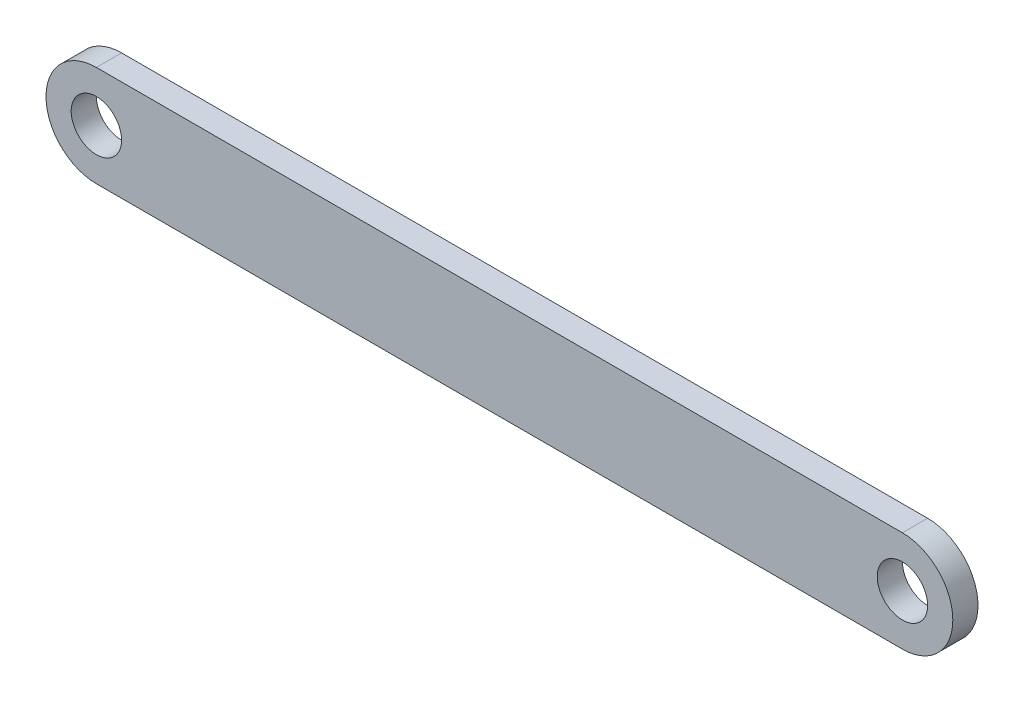
ISO-10303-21;
HEADER;
FILE_DESCRIPTION(('STEP AP214'),'2;1');
FILE_NAME('part.step','',(''),(''),'','','');
FILE_SCHEMA(('AUTOMOTIVE_DESIGN { 1 0 10303 214 1 1 1 1 }'));
ENDSEC;
DATA;
#1=APPLICATION_CONTEXT('core data for automotive mechanical design processes');
#2=APPLICATION_PROTOCOL_DEFINITION('international standard','automotive_design',2000,#1);
#3=PRODUCT_CONTEXT('',#1,'mechanical');
#4=PRODUCT('Part','Part','',(#3));
#5=PRODUCT_RELATED_PRODUCT_CATEGORY('part','',(#4));
#6=PRODUCT_DEFINITION_FORMATION('','',#4);
#7=PRODUCT_DEFINITION_CONTEXT('part definition',#1,'design');
#8=PRODUCT_DEFINITION('design','',#6,#7);
#9=PRODUCT_DEFINITION_SHAPE('','',#8);
#10=(LENGTH_UNIT() NAMED_UNIT(*) SI_UNIT(.MILLI.,.METRE.));
#11=(NAMED_UNIT(*) PLANE_ANGLE_UNIT() SI_UNIT($,.RADIAN.));
#12=(NAMED_UNIT(*) SI_UNIT($,.STERADIAN.) SOLID_ANGLE_UNIT());
#13=UNCERTAINTY_MEASURE_WITH_UNIT(LENGTH_MEASURE(1.E-05),#10,'distance_accuracy_value','');
#14=(GEOMETRIC_REPRESENTATION_CONTEXT(3) GLOBAL_UNCERTAINTY_ASSIGNED_CONTEXT((#13)) GLOBAL_UNIT_ASSIGNED_CONTEXT((#10,
#11,#12)) REPRESENTATION_CONTEXT('',''));
#15=CARTESIAN_POINT('',(0.,0.,0.));
#16=DIRECTION('',(0.,0.,1.));
#17=DIRECTION('',(1.,0.,0.));
#18=AXIS2_PLACEMENT_3D('',#15,#16,#17);
#19=CARTESIAN_POINT('',(-101.6,0.,6.35));
#20=DIRECTION('',(0.,0.,-1.));
#21=DIRECTION('',(-1.,0.,0.));
#22=AXIS2_PLACEMENT_3D('',#19,#20,#21);
#23=CYLINDRICAL_SURFACE('',#22,12.7);
#24=CARTESIAN_POINT('',(-101.6,0.,0.));
#25=DIRECTION('',(0.,0.,1.));
#26=DIRECTION('',(-1.,0.,0.));
#27=AXIS2_PLACEMENT_3D('',#24,#25,#26);
#28=CIRCLE('',#27,12.7);
#29=CARTESIAN_POINT('',(-101.6,12.7,0.));
#30=VERTEX_POINT('',#29);
#31=CARTESIAN_POINT('',(-101.6,-12.7,0.));
#32=VERTEX_POINT('',#31);
#33=EDGE_CURVE('E95',#30,#32,#28,.T.);
#34=ORIENTED_EDGE('',*,*,#33,.T.);
#35=DIRECTION('',(0.,0.,-1.));
#36=VECTOR('',#35,1.);
#37=CARTESIAN_POINT('',(-101.6,-12.7,6.35));
#38=LINE('',#37,#36);
#39=CARTESIAN_POINT('',(-101.6,-12.7,6.35));
#40=VERTEX_POINT('',#39);
#41=EDGE_CURVE('E11',#40,#32,#38,.T.);
#42=ORIENTED_EDGE('',*,*,#41,.F.);
#43=CARTESIAN_POINT('',(-101.6,0.,6.35));
#44=DIRECTION('',(0.,0.,1.));
#45=DIRECTION('',(-1.,0.,0.));
#46=AXIS2_PLACEMENT_3D('',#43,#44,#45);
#47=CIRCLE('',#46,12.7);
#48=CARTESIAN_POINT('',(-101.6,12.7,6.35));
#49=VERTEX_POINT('',#48);
#50=EDGE_CURVE('E83',#49,#40,#47,.T.);
#51=ORIENTED_EDGE('',*,*,#50,.F.);
#52=DIRECTION('',(0.,0.,-1.));
#53=VECTOR('',#52,1.);
#54=CARTESIAN_POINT('',(-101.6,12.7,6.35));
#55=LINE('',#54,#53);
#56=EDGE_CURVE('E91',#49,#30,#55,.T.);
#57=ORIENTED_EDGE('',*,*,#56,.T.);
#58=EDGE_LOOP('',(#34,#42,#51,#57));
#59=FACE_BOUND('',#58,.T.);
#60=ADVANCED_FACE('F32',(#59),#23,.T.);
#61=CARTESIAN_POINT('',(-101.6,-12.7,6.35));
#62=DIRECTION('',(0.,1.,0.));
#63=DIRECTION('',(-1.,0.,0.));
#64=AXIS2_PLACEMENT_3D('',#61,#62,#63);
#65=PLANE('',#64);
#66=DIRECTION('',(1.,0.,0.));
#67=VECTOR('',#66,1.);
#68=CARTESIAN_POINT('',(-101.6,-12.7,0.));
#69=LINE('',#68,#67);
#70=CARTESIAN_POINT('',(101.6,-12.7,0.));
#71=VERTEX_POINT('',#70);
#72=EDGE_CURVE('E87',#32,#71,#69,.T.);
#73=ORIENTED_EDGE('',*,*,#72,.T.);
#74=DIRECTION('',(0.,0.,-1.));
#75=VECTOR('',#74,1.);
#76=CARTESIAN_POINT('',(101.6,-12.7,6.35));
#77=LINE('',#76,#75);
#78=CARTESIAN_POINT('',(101.6,-12.7,6.35));
#79=VERTEX_POINT('',#78);
#80=EDGE_CURVE('E40',#79,#71,#77,.T.);
#81=ORIENTED_EDGE('',*,*,#80,.F.);
#82=DIRECTION('',(1.,0.,0.));
#83=VECTOR('',#82,1.);
#84=CARTESIAN_POINT('',(-101.6,-12.7,6.35));
#85=LINE('',#84,#83);
#86=EDGE_CURVE('E78',#40,#79,#85,.T.);
#87=ORIENTED_EDGE('',*,*,#86,.F.);
#88=ORIENTED_EDGE('',*,*,#41,.T.);
#89=EDGE_LOOP('',(#73,#81,#87,#88));
#90=FACE_BOUND('',#89,.T.);
#91=ADVANCED_FACE('F86',(#90),#65,.F.);
#92=CARTESIAN_POINT('',(101.6,0.,6.35));
#93=DIRECTION('',(0.,0.,-1.));
#94=DIRECTION('',(-1.,0.,0.));
#95=AXIS2_PLACEMENT_3D('',#92,#93,#94);
#96=CYLINDRICAL_SURFACE('',#95,12.7);
#97=CARTESIAN_POINT('',(101.6,0.,0.));
#98=DIRECTION('',(0.,0.,1.));
#99=DIRECTION('',(-1.,0.,0.));
#100=AXIS2_PLACEMENT_3D('',#97,#98,#99);
#101=CIRCLE('',#100,12.7);
#102=CARTESIAN_POINT('',(101.6,12.7,0.));
#103=VERTEX_POINT('',#102);
#104=EDGE_CURVE('E65',#71,#103,#101,.T.);
#105=ORIENTED_EDGE('',*,*,#104,.T.);
#106=DIRECTION('',(0.,0.,-1.));
#107=VECTOR('',#106,1.);
#108=CARTESIAN_POINT('',(101.6,12.7,6.35));
#109=LINE('',#108,#107);
#110=CARTESIAN_POINT('',(101.6,12.7,6.35));
#111=VERTEX_POINT('',#110);
#112=EDGE_CURVE('E88',#111,#103,#109,.T.);
#113=ORIENTED_EDGE('',*,*,#112,.F.);
#114=CARTESIAN_POINT('',(101.6,0.,6.35));
#115=DIRECTION('',(0.,0.,1.));
#116=DIRECTION('',(-1.,0.,0.));
#117=AXIS2_PLACEMENT_3D('',#114,#115,#116);
#118=CIRCLE('',#117,12.7);
#119=EDGE_CURVE('E81',#79,#111,#118,.T.);
#120=ORIENTED_EDGE('',*,*,#119,.F.);
#121=ORIENTED_EDGE('',*,*,#80,.T.);
#122=EDGE_LOOP('',(#105,#113,#120,#121));
#123=FACE_BOUND('',#122,.T.);
#124=ADVANCED_FACE('F89',(#123),#96,.T.);
#125=CARTESIAN_POINT('',(-101.6,12.7,6.35));
#126=DIRECTION('',(0.,-1.,0.));
#127=DIRECTION('',(1.,0.,0.));
#128=AXIS2_PLACEMENT_3D('',#125,#126,#127);
#129=PLANE('',#128);
#130=DIRECTION('',(-1.,0.,0.));
#131=VECTOR('',#130,1.);
#132=CARTESIAN_POINT('',(-101.6,12.7,0.));
#133=LINE('',#132,#131);
#134=EDGE_CURVE('E71',#103,#30,#133,.T.);
#135=ORIENTED_EDGE('',*,*,#134,.T.);
#136=ORIENTED_EDGE('',*,*,#56,.F.);
#137=DIRECTION('',(-1.,0.,0.));
#138=VECTOR('',#137,1.);
#139=CARTESIAN_POINT('',(-101.6,12.7,6.35));
#140=LINE('',#139,#138);
#141=EDGE_CURVE('E48',#111,#49,#140,.T.);
#142=ORIENTED_EDGE('',*,*,#141,.F.);
#143=ORIENTED_EDGE('',*,*,#112,.T.);
#144=EDGE_LOOP('',(#135,#136,#142,#143));
#145=FACE_BOUND('',#144,.T.);
#146=ADVANCED_FACE('F103',(#145),#129,.F.);
#147=CARTESIAN_POINT('',(-101.6,0.,6.35));
#148=DIRECTION('',(0.,0.,-1.));
#149=DIRECTION('',(-1.,0.,0.));
#150=AXIS2_PLACEMENT_3D('',#147,#148,#149);
#151=PLANE('',#150);
#152=CARTESIAN_POINT('',(101.6,0.,6.35));
#153=DIRECTION('',(0.,0.,1.));
#154=DIRECTION('',(1.,0.,0.));
#155=AXIS2_PLACEMENT_3D('',#152,#153,#154);
#156=CIRCLE('',#155,6.35);
#157=CARTESIAN_POINT('',(107.95,0.,6.35));
#158=VERTEX_POINT('',#157);
#159=EDGE_CURVE('E115',#158,#158,#156,.T.);
#160=ORIENTED_EDGE('',*,*,#159,.F.);
#161=EDGE_LOOP('',(#160));
#162=FACE_BOUND('',#161,.T.);
#163=CARTESIAN_POINT('',(-101.6,0.,6.35));
#164=DIRECTION('',(0.,0.,1.));
#165=DIRECTION('',(1.,0.,0.));
#166=AXIS2_PLACEMENT_3D('',#163,#164,#165);
#167=CIRCLE('',#166,6.35);
#168=CARTESIAN_POINT('',(-95.25,0.,6.35));
#169=VERTEX_POINT('',#168);
#170=EDGE_CURVE('E109',#169,#169,#167,.T.);
#171=ORIENTED_EDGE('',*,*,#170,.F.);
#172=EDGE_LOOP('',(#171));
#173=FACE_BOUND('',#172,.T.);
#174=ORIENTED_EDGE('',*,*,#50,.T.);
#175=ORIENTED_EDGE('',*,*,#86,.T.);
#176=ORIENTED_EDGE('',*,*,#119,.T.);
#177=ORIENTED_EDGE('',*,*,#141,.T.);
#178=EDGE_LOOP('',(#174,#175,#176,#177));
#179=FACE_BOUND('',#178,.T.);
#180=ADVANCED_FACE('F79',(#162,#173,#179),#151,.F.);
#181=CARTESIAN_POINT('',(-101.6,0.,0.));
#182=DIRECTION('',(0.,0.,-1.));
#183=DIRECTION('',(-1.,0.,0.));
#184=AXIS2_PLACEMENT_3D('',#181,#182,#183);
#185=PLANE('',#184);
#186=CARTESIAN_POINT('',(101.6,0.,0.));
#187=DIRECTION('',(0.,0.,1.));
#188=DIRECTION('',(1.,0.,0.));
#189=AXIS2_PLACEMENT_3D('',#186,#187,#188);
#190=CIRCLE('',#189,6.35);
#191=CARTESIAN_POINT('',(107.95,0.,0.));
#192=VERTEX_POINT('',#191);
#193=EDGE_CURVE('E112',#192,#192,#190,.T.);
#194=ORIENTED_EDGE('',*,*,#193,.T.);
#195=EDGE_LOOP('',(#194));
#196=FACE_BOUND('',#195,.T.);
#197=CARTESIAN_POINT('',(-101.6,0.,0.));
#198=DIRECTION('',(0.,0.,1.));
#199=DIRECTION('',(1.,0.,0.));
#200=AXIS2_PLACEMENT_3D('',#197,#198,#199);
#201=CIRCLE('',#200,6.35);
#202=CARTESIAN_POINT('',(-95.25,0.,0.));
#203=VERTEX_POINT('',#202);
#204=EDGE_CURVE('E98',#203,#203,#201,.T.);
#205=ORIENTED_EDGE('',*,*,#204,.T.);
#206=EDGE_LOOP('',(#205));
#207=FACE_BOUND('',#206,.T.);
#208=ORIENTED_EDGE('',*,*,#33,.F.);
#209=ORIENTED_EDGE('',*,*,#134,.F.);
#210=ORIENTED_EDGE('',*,*,#104,.F.);
#211=ORIENTED_EDGE('',*,*,#72,.F.);
#212=EDGE_LOOP('',(#208,#209,#210,#211));
#213=FACE_BOUND('',#212,.T.);
#214=ADVANCED_FACE('F106',(#196,#207,#213),#185,.T.);
#215=CARTESIAN_POINT('',(-101.6,0.,0.));
#216=DIRECTION('',(0.,0.,1.));
#217=DIRECTION('',(1.,0.,0.));
#218=AXIS2_PLACEMENT_3D('',#215,#216,#217);
#219=CYLINDRICAL_SURFACE('',#218,6.35);
#220=ORIENTED_EDGE('',*,*,#204,.F.);
#221=EDGE_LOOP('',(#220));
#222=FACE_BOUND('',#221,.T.);
#223=ORIENTED_EDGE('',*,*,#170,.T.);
#224=EDGE_LOOP('',(#223));
#225=FACE_BOUND('',#224,.T.);
#226=ADVANCED_FACE('F126',(#222,#225),#219,.F.);
#227=CARTESIAN_POINT('',(101.6,0.,0.));
#228=DIRECTION('',(0.,0.,1.));
#229=DIRECTION('',(1.,0.,0.));
#230=AXIS2_PLACEMENT_3D('',#227,#228,#229);
#231=CYLINDRICAL_SURFACE('',#230,6.35);
#232=ORIENTED_EDGE('',*,*,#193,.F.);
#233=EDGE_LOOP('',(#232));
#234=FACE_BOUND('',#233,.T.);
#235=ORIENTED_EDGE('',*,*,#159,.T.);
#236=EDGE_LOOP('',(#235));
#237=FACE_BOUND('',#236,.T.);
#238=ADVANCED_FACE('F123',(#234,#237),#231,.F.);
#239=CLOSED_SHELL('',(#60,#91,#124,#146,#180,#214,#226,#238));
#240=MANIFOLD_SOLID_BREP('B2',#239);
#241=ADVANCED_BREP_SHAPE_REPRESENTATION('',(#18,#240),#14);
#242=SHAPE_DEFINITION_REPRESENTATION(#9,#241);
ENDSEC;
END-ISO-10303-21;
